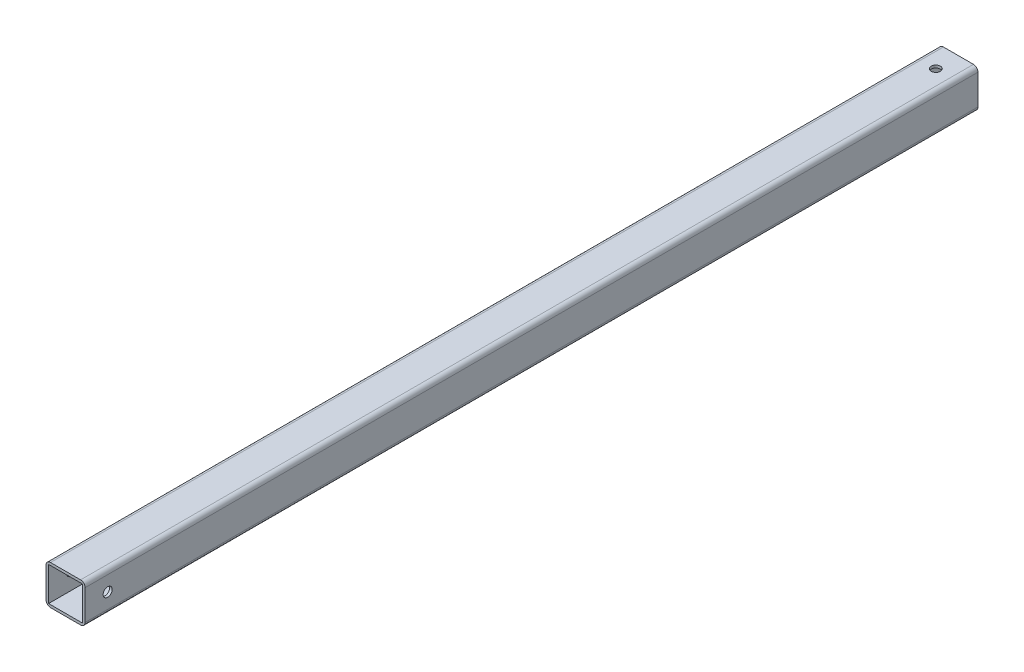
ISO-10303-21;
HEADER;
FILE_DESCRIPTION(('STEP AP214'),'2;1');
FILE_NAME('part.step','',(''),(''),'','','');
FILE_SCHEMA(('AUTOMOTIVE_DESIGN { 1 0 10303 214 1 1 1 1 }'));
ENDSEC;
DATA;
#1=APPLICATION_CONTEXT('core data for automotive mechanical design processes');
#2=APPLICATION_PROTOCOL_DEFINITION('international standard','automotive_design',2000,#1);
#3=PRODUCT_CONTEXT('',#1,'mechanical');
#4=PRODUCT('Part','Part','',(#3));
#5=PRODUCT_RELATED_PRODUCT_CATEGORY('part','',(#4));
#6=PRODUCT_DEFINITION_FORMATION('','',#4);
#7=PRODUCT_DEFINITION_CONTEXT('part definition',#1,'design');
#8=PRODUCT_DEFINITION('design','',#6,#7);
#9=PRODUCT_DEFINITION_SHAPE('','',#8);
#10=(LENGTH_UNIT() NAMED_UNIT(*) SI_UNIT(.MILLI.,.METRE.));
#11=(NAMED_UNIT(*) PLANE_ANGLE_UNIT() SI_UNIT($,.RADIAN.));
#12=(NAMED_UNIT(*) SI_UNIT($,.STERADIAN.) SOLID_ANGLE_UNIT());
#13=UNCERTAINTY_MEASURE_WITH_UNIT(LENGTH_MEASURE(1.E-05),#10,'distance_accuracy_value','');
#14=(GEOMETRIC_REPRESENTATION_CONTEXT(3) GLOBAL_UNCERTAINTY_ASSIGNED_CONTEXT((#13)) GLOBAL_UNIT_ASSIGNED_CONTEXT((#10,
#11,#12)) REPRESENTATION_CONTEXT('',''));
#15=CARTESIAN_POINT('',(0.,0.,0.));
#16=DIRECTION('',(0.,0.,1.));
#17=DIRECTION('',(1.,0.,0.));
#18=AXIS2_PLACEMENT_3D('',#15,#16,#17);
#19=CARTESIAN_POINT('',(0.,0.,501.65));
#20=DIRECTION('',(0.,0.,1.));
#21=DIRECTION('',(1.,0.,0.));
#22=AXIS2_PLACEMENT_3D('',#19,#20,#21);
#23=PLANE('',#22);
#24=DIRECTION('',(0.,-1.,0.));
#25=VECTOR('',#24,1.);
#26=CARTESIAN_POINT('',(-10.9855,-10.9855,501.65));
#27=LINE('',#26,#25);
#28=CARTESIAN_POINT('',(-10.9855,8.44549999999999,501.65));
#29=VERTEX_POINT('',#28);
#30=CARTESIAN_POINT('',(-10.9855,-8.4455,501.65));
#31=VERTEX_POINT('',#30);
#32=EDGE_CURVE('E168',#29,#31,#27,.T.);
#33=ORIENTED_EDGE('',*,*,#32,.T.);
#34=CARTESIAN_POINT('',(-8.4455,-8.4455,501.65));
#35=DIRECTION('',(0.,0.,1.));
#36=DIRECTION('',(1.,0.,0.));
#37=AXIS2_PLACEMENT_3D('',#34,#35,#36);
#38=CIRCLE('',#37,2.54);
#39=CARTESIAN_POINT('',(-8.44549999999999,-10.9855,501.65));
#40=VERTEX_POINT('',#39);
#41=EDGE_CURVE('E211',#31,#40,#38,.T.);
#42=ORIENTED_EDGE('',*,*,#41,.T.);
#43=DIRECTION('',(1.,0.,0.));
#44=VECTOR('',#43,1.);
#45=CARTESIAN_POINT('',(10.9855,-10.9855,501.65));
#46=LINE('',#45,#44);
#47=CARTESIAN_POINT('',(8.4455,-10.9855,501.65));
#48=VERTEX_POINT('',#47);
#49=EDGE_CURVE('E171',#40,#48,#46,.T.);
#50=ORIENTED_EDGE('',*,*,#49,.T.);
#51=CARTESIAN_POINT('',(8.4455,-8.4455,501.65));
#52=DIRECTION('',(0.,0.,1.));
#53=DIRECTION('',(1.,0.,0.));
#54=AXIS2_PLACEMENT_3D('',#51,#52,#53);
#55=CIRCLE('',#54,2.54);
#56=CARTESIAN_POINT('',(10.9855,-8.4455,501.65));
#57=VERTEX_POINT('',#56);
#58=EDGE_CURVE('E209',#48,#57,#55,.T.);
#59=ORIENTED_EDGE('',*,*,#58,.T.);
#60=DIRECTION('',(0.,1.,0.));
#61=VECTOR('',#60,1.);
#62=CARTESIAN_POINT('',(10.9855,-10.9855,501.65));
#63=LINE('',#62,#61);
#64=CARTESIAN_POINT('',(10.9855,8.44549999999999,501.65));
#65=VERTEX_POINT('',#64);
#66=EDGE_CURVE('E175',#57,#65,#63,.T.);
#67=ORIENTED_EDGE('',*,*,#66,.T.);
#68=CARTESIAN_POINT('',(8.4455,8.4455,501.65));
#69=DIRECTION('',(0.,0.,1.));
#70=DIRECTION('',(1.,0.,0.));
#71=AXIS2_PLACEMENT_3D('',#68,#69,#70);
#72=CIRCLE('',#71,2.54);
#73=CARTESIAN_POINT('',(8.4455,10.9855,501.65));
#74=VERTEX_POINT('',#73);
#75=EDGE_CURVE('E55',#65,#74,#72,.T.);
#76=ORIENTED_EDGE('',*,*,#75,.T.);
#77=DIRECTION('',(-1.,0.,0.));
#78=VECTOR('',#77,1.);
#79=CARTESIAN_POINT('',(10.9855,10.9855,501.65));
#80=LINE('',#79,#78);
#81=CARTESIAN_POINT('',(-8.44549999999999,10.9855,501.65));
#82=VERTEX_POINT('',#81);
#83=EDGE_CURVE('E177',#74,#82,#80,.T.);
#84=ORIENTED_EDGE('',*,*,#83,.T.);
#85=CARTESIAN_POINT('',(-8.4455,8.4455,501.65));
#86=DIRECTION('',(0.,0.,1.));
#87=DIRECTION('',(1.,0.,0.));
#88=AXIS2_PLACEMENT_3D('',#85,#86,#87);
#89=CIRCLE('',#88,2.54);
#90=EDGE_CURVE('E207',#82,#29,#89,.T.);
#91=ORIENTED_EDGE('',*,*,#90,.T.);
#92=EDGE_LOOP('',(#33,#42,#50,#59,#67,#76,#84,#91));
#93=FACE_BOUND('',#92,.T.);
#94=DIRECTION('',(1.,0.,0.));
#95=VECTOR('',#94,1.);
#96=CARTESIAN_POINT('',(9.525,-9.525,501.65));
#97=LINE('',#96,#95);
#98=CARTESIAN_POINT('',(-9.525,-9.525,501.65));
#99=VERTEX_POINT('',#98);
#100=CARTESIAN_POINT('',(9.525,-9.525,501.65));
#101=VERTEX_POINT('',#100);
#102=EDGE_CURVE('E135',#99,#101,#97,.T.);
#103=ORIENTED_EDGE('',*,*,#102,.F.);
#104=DIRECTION('',(0.,-1.,0.));
#105=VECTOR('',#104,1.);
#106=CARTESIAN_POINT('',(-9.525,-9.525,501.65));
#107=LINE('',#106,#105);
#108=CARTESIAN_POINT('',(-9.525,9.52499999999999,501.65));
#109=VERTEX_POINT('',#108);
#110=EDGE_CURVE('E125',#109,#99,#107,.T.);
#111=ORIENTED_EDGE('',*,*,#110,.F.);
#112=DIRECTION('',(-1.,0.,0.));
#113=VECTOR('',#112,1.);
#114=CARTESIAN_POINT('',(9.525,9.52499999999999,501.65));
#115=LINE('',#114,#113);
#116=CARTESIAN_POINT('',(9.525,9.52499999999999,501.65));
#117=VERTEX_POINT('',#116);
#118=EDGE_CURVE('E150',#117,#109,#115,.T.);
#119=ORIENTED_EDGE('',*,*,#118,.F.);
#120=DIRECTION('',(0.,1.,0.));
#121=VECTOR('',#120,1.);
#122=CARTESIAN_POINT('',(9.525,-9.525,501.65));
#123=LINE('',#122,#121);
#124=EDGE_CURVE('E148',#101,#117,#123,.T.);
#125=ORIENTED_EDGE('',*,*,#124,.F.);
#126=EDGE_LOOP('',(#103,#111,#119,#125));
#127=FACE_BOUND('',#126,.T.);
#128=ADVANCED_FACE('F34',(#93,#127),#23,.T.);
#129=CARTESIAN_POINT('',(0.,0.,0.));
#130=DIRECTION('',(0.,0.,1.));
#131=DIRECTION('',(1.,0.,0.));
#132=AXIS2_PLACEMENT_3D('',#129,#130,#131);
#133=PLANE('',#132);
#134=DIRECTION('',(1.,0.,0.));
#135=VECTOR('',#134,1.);
#136=CARTESIAN_POINT('',(10.9855,-10.9855,0.));
#137=LINE('',#136,#135);
#138=CARTESIAN_POINT('',(-8.44549999999999,-10.9855,0.));
#139=VERTEX_POINT('',#138);
#140=CARTESIAN_POINT('',(8.4455,-10.9855,0.));
#141=VERTEX_POINT('',#140);
#142=EDGE_CURVE('E182',#139,#141,#137,.T.);
#143=ORIENTED_EDGE('',*,*,#142,.F.);
#144=CARTESIAN_POINT('',(-8.4455,-8.4455,0.));
#145=DIRECTION('',(0.,0.,1.));
#146=DIRECTION('',(1.,0.,0.));
#147=AXIS2_PLACEMENT_3D('',#144,#145,#146);
#148=CIRCLE('',#147,2.54);
#149=CARTESIAN_POINT('',(-10.9855,-8.4455,0.));
#150=VERTEX_POINT('',#149);
#151=EDGE_CURVE('E199',#139,#150,#148,.F.);
#152=ORIENTED_EDGE('',*,*,#151,.T.);
#153=DIRECTION('',(0.,-1.,0.));
#154=VECTOR('',#153,1.);
#155=CARTESIAN_POINT('',(-10.9855,-10.9855,0.));
#156=LINE('',#155,#154);
#157=CARTESIAN_POINT('',(-10.9855,8.44549999999999,0.));
#158=VERTEX_POINT('',#157);
#159=EDGE_CURVE('E143',#158,#150,#156,.T.);
#160=ORIENTED_EDGE('',*,*,#159,.F.);
#161=CARTESIAN_POINT('',(-8.4455,8.4455,0.));
#162=DIRECTION('',(0.,0.,1.));
#163=DIRECTION('',(1.,0.,0.));
#164=AXIS2_PLACEMENT_3D('',#161,#162,#163);
#165=CIRCLE('',#164,2.54);
#166=CARTESIAN_POINT('',(-8.44549999999999,10.9855,0.));
#167=VERTEX_POINT('',#166);
#168=EDGE_CURVE('E195',#158,#167,#165,.F.);
#169=ORIENTED_EDGE('',*,*,#168,.T.);
#170=DIRECTION('',(-1.,0.,0.));
#171=VECTOR('',#170,1.);
#172=CARTESIAN_POINT('',(10.9855,10.9855,0.));
#173=LINE('',#172,#171);
#174=CARTESIAN_POINT('',(8.4455,10.9855,0.));
#175=VERTEX_POINT('',#174);
#176=EDGE_CURVE('E172',#175,#167,#173,.T.);
#177=ORIENTED_EDGE('',*,*,#176,.F.);
#178=CARTESIAN_POINT('',(8.4455,8.4455,0.));
#179=DIRECTION('',(0.,0.,1.));
#180=DIRECTION('',(1.,0.,0.));
#181=AXIS2_PLACEMENT_3D('',#178,#179,#180);
#182=CIRCLE('',#181,2.54);
#183=CARTESIAN_POINT('',(10.9855,8.44549999999999,0.));
#184=VERTEX_POINT('',#183);
#185=EDGE_CURVE('E193',#175,#184,#182,.F.);
#186=ORIENTED_EDGE('',*,*,#185,.T.);
#187=DIRECTION('',(0.,1.,0.));
#188=VECTOR('',#187,1.);
#189=CARTESIAN_POINT('',(10.9855,-10.9855,0.));
#190=LINE('',#189,#188);
#191=CARTESIAN_POINT('',(10.9855,-8.4455,0.));
#192=VERTEX_POINT('',#191);
#193=EDGE_CURVE('E185',#192,#184,#190,.T.);
#194=ORIENTED_EDGE('',*,*,#193,.F.);
#195=CARTESIAN_POINT('',(8.4455,-8.4455,0.));
#196=DIRECTION('',(0.,0.,1.));
#197=DIRECTION('',(1.,0.,0.));
#198=AXIS2_PLACEMENT_3D('',#195,#196,#197);
#199=CIRCLE('',#198,2.54);
#200=EDGE_CURVE('E197',#192,#141,#199,.F.);
#201=ORIENTED_EDGE('',*,*,#200,.T.);
#202=EDGE_LOOP('',(#143,#152,#160,#169,#177,#186,#194,#201));
#203=FACE_BOUND('',#202,.T.);
#204=DIRECTION('',(0.,-1.,0.));
#205=VECTOR('',#204,1.);
#206=CARTESIAN_POINT('',(-9.525,-9.525,0.));
#207=LINE('',#206,#205);
#208=CARTESIAN_POINT('',(-9.525,9.52499999999999,0.));
#209=VERTEX_POINT('',#208);
#210=CARTESIAN_POINT('',(-9.525,-9.525,0.));
#211=VERTEX_POINT('',#210);
#212=EDGE_CURVE('E155',#209,#211,#207,.T.);
#213=ORIENTED_EDGE('',*,*,#212,.T.);
#214=DIRECTION('',(1.,0.,0.));
#215=VECTOR('',#214,1.);
#216=CARTESIAN_POINT('',(9.525,-9.525,0.));
#217=LINE('',#216,#215);
#218=CARTESIAN_POINT('',(9.525,-9.525,0.));
#219=VERTEX_POINT('',#218);
#220=EDGE_CURVE('E142',#211,#219,#217,.T.);
#221=ORIENTED_EDGE('',*,*,#220,.T.);
#222=DIRECTION('',(0.,1.,0.));
#223=VECTOR('',#222,1.);
#224=CARTESIAN_POINT('',(9.525,-9.525,0.));
#225=LINE('',#224,#223);
#226=CARTESIAN_POINT('',(9.525,9.52499999999999,0.));
#227=VERTEX_POINT('',#226);
#228=EDGE_CURVE('E159',#219,#227,#225,.T.);
#229=ORIENTED_EDGE('',*,*,#228,.T.);
#230=DIRECTION('',(-1.,0.,0.));
#231=VECTOR('',#230,1.);
#232=CARTESIAN_POINT('',(9.525,9.52499999999999,0.));
#233=LINE('',#232,#231);
#234=EDGE_CURVE('E136',#227,#209,#233,.T.);
#235=ORIENTED_EDGE('',*,*,#234,.T.);
#236=EDGE_LOOP('',(#213,#221,#229,#235));
#237=FACE_BOUND('',#236,.T.);
#238=ADVANCED_FACE('F225',(#203,#237),#133,.F.);
#239=CARTESIAN_POINT('',(-10.9855,-10.9855,501.65));
#240=DIRECTION('',(1.,0.,0.));
#241=DIRECTION('',(0.,0.,-1.));
#242=AXIS2_PLACEMENT_3D('',#239,#240,#241);
#243=PLANE('',#242);
#244=CARTESIAN_POINT('',(-10.9855,0.,488.95));
#245=DIRECTION('',(1.,0.,0.));
#246=DIRECTION('',(0.,0.,-1.));
#247=AXIS2_PLACEMENT_3D('',#244,#245,#246);
#248=CIRCLE('',#247,2.5527);
#249=CARTESIAN_POINT('',(-10.9855,0.,486.3973));
#250=VERTEX_POINT('',#249);
#251=EDGE_CURVE('E406',#250,#250,#248,.T.);
#252=ORIENTED_EDGE('',*,*,#251,.T.);
#253=EDGE_LOOP('',(#252));
#254=FACE_BOUND('',#253,.T.);
#255=ORIENTED_EDGE('',*,*,#159,.T.);
#256=DIRECTION('',(0.,0.,-1.));
#257=VECTOR('',#256,1.);
#258=CARTESIAN_POINT('',(-10.9855,-8.4455,501.65));
#259=LINE('',#258,#257);
#260=EDGE_CURVE('E204',#150,#31,#259,.F.);
#261=ORIENTED_EDGE('',*,*,#260,.T.);
#262=ORIENTED_EDGE('',*,*,#32,.F.);
#263=DIRECTION('',(0.,0.,-1.));
#264=VECTOR('',#263,1.);
#265=CARTESIAN_POINT('',(-10.9855,8.4455,501.65));
#266=LINE('',#265,#264);
#267=EDGE_CURVE('E201',#29,#158,#266,.T.);
#268=ORIENTED_EDGE('',*,*,#267,.T.);
#269=EDGE_LOOP('',(#255,#261,#262,#268));
#270=FACE_BOUND('',#269,.T.);
#271=ADVANCED_FACE('F235',(#254,#270),#243,.F.);
#272=CARTESIAN_POINT('',(10.9855,-10.9855,501.65));
#273=DIRECTION('',(0.,1.,0.));
#274=DIRECTION('',(-1.,0.,0.));
#275=AXIS2_PLACEMENT_3D('',#272,#273,#274);
#276=PLANE('',#275);
#277=ORIENTED_EDGE('',*,*,#49,.F.);
#278=DIRECTION('',(0.,0.,-1.));
#279=VECTOR('',#278,1.);
#280=CARTESIAN_POINT('',(-8.4455,-10.9855,501.65));
#281=LINE('',#280,#279);
#282=EDGE_CURVE('E190',#40,#139,#281,.T.);
#283=ORIENTED_EDGE('',*,*,#282,.T.);
#284=ORIENTED_EDGE('',*,*,#142,.T.);
#285=DIRECTION('',(0.,0.,-1.));
#286=VECTOR('',#285,1.);
#287=CARTESIAN_POINT('',(8.4455,-10.9855,501.65));
#288=LINE('',#287,#286);
#289=EDGE_CURVE('E179',#141,#48,#288,.F.);
#290=ORIENTED_EDGE('',*,*,#289,.T.);
#291=EDGE_LOOP('',(#277,#283,#284,#290));
#292=FACE_BOUND('',#291,.T.);
#293=ADVANCED_FACE('F243',(#292),#276,.F.);
#294=CARTESIAN_POINT('',(10.9855,-10.9855,501.65));
#295=DIRECTION('',(-1.,0.,0.));
#296=DIRECTION('',(0.,0.,1.));
#297=AXIS2_PLACEMENT_3D('',#294,#295,#296);
#298=PLANE('',#297);
#299=CARTESIAN_POINT('',(10.9855,0.,488.95));
#300=DIRECTION('',(1.,0.,0.));
#301=DIRECTION('',(0.,0.,-1.));
#302=AXIS2_PLACEMENT_3D('',#299,#300,#301);
#303=CIRCLE('',#302,2.55269999999999);
#304=CARTESIAN_POINT('',(10.9855,0.,486.3973));
#305=VERTEX_POINT('',#304);
#306=EDGE_CURVE('E407',#305,#305,#303,.T.);
#307=ORIENTED_EDGE('',*,*,#306,.F.);
#308=EDGE_LOOP('',(#307));
#309=FACE_BOUND('',#308,.T.);
#310=ORIENTED_EDGE('',*,*,#66,.F.);
#311=DIRECTION('',(0.,0.,-1.));
#312=VECTOR('',#311,1.);
#313=CARTESIAN_POINT('',(10.9855,-8.4455,501.65));
#314=LINE('',#313,#312);
#315=EDGE_CURVE('E215',#57,#192,#314,.T.);
#316=ORIENTED_EDGE('',*,*,#315,.T.);
#317=ORIENTED_EDGE('',*,*,#193,.T.);
#318=DIRECTION('',(0.,0.,-1.));
#319=VECTOR('',#318,1.);
#320=CARTESIAN_POINT('',(10.9855,8.4455,501.65));
#321=LINE('',#320,#319);
#322=EDGE_CURVE('E213',#184,#65,#321,.F.);
#323=ORIENTED_EDGE('',*,*,#322,.T.);
#324=EDGE_LOOP('',(#310,#316,#317,#323));
#325=FACE_BOUND('',#324,.T.);
#326=ADVANCED_FACE('F251',(#309,#325),#298,.F.);
#327=CARTESIAN_POINT('',(10.9855,10.9855,501.65));
#328=DIRECTION('',(0.,-1.,0.));
#329=DIRECTION('',(0.,0.,-1.));
#330=AXIS2_PLACEMENT_3D('',#327,#328,#329);
#331=PLANE('',#330);
#332=CARTESIAN_POINT('',(0.,10.9855,12.7));
#333=DIRECTION('',(0.,1.,0.));
#334=DIRECTION('',(0.,0.,1.));
#335=AXIS2_PLACEMENT_3D('',#332,#333,#334);
#336=CIRCLE('',#335,2.5527);
#337=CARTESIAN_POINT('',(0.,10.9855,15.2527));
#338=VERTEX_POINT('',#337);
#339=EDGE_CURVE('E414',#338,#338,#336,.T.);
#340=ORIENTED_EDGE('',*,*,#339,.F.);
#341=EDGE_LOOP('',(#340));
#342=FACE_BOUND('',#341,.T.);
#343=ORIENTED_EDGE('',*,*,#176,.T.);
#344=DIRECTION('',(0.,0.,-1.));
#345=VECTOR('',#344,1.);
#346=CARTESIAN_POINT('',(-8.4455,10.9855,501.65));
#347=LINE('',#346,#345);
#348=EDGE_CURVE('E11',#167,#82,#347,.F.);
#349=ORIENTED_EDGE('',*,*,#348,.T.);
#350=ORIENTED_EDGE('',*,*,#83,.F.);
#351=DIRECTION('',(0.,0.,-1.));
#352=VECTOR('',#351,1.);
#353=CARTESIAN_POINT('',(8.4455,10.9855,501.65));
#354=LINE('',#353,#352);
#355=EDGE_CURVE('E43',#74,#175,#354,.T.);
#356=ORIENTED_EDGE('',*,*,#355,.T.);
#357=EDGE_LOOP('',(#343,#349,#350,#356));
#358=FACE_BOUND('',#357,.T.);
#359=ADVANCED_FACE('F221',(#342,#358),#331,.F.);
#360=CARTESIAN_POINT('',(-9.525,-9.525,501.65));
#361=DIRECTION('',(1.,0.,0.));
#362=DIRECTION('',(0.,0.,-1.));
#363=AXIS2_PLACEMENT_3D('',#360,#361,#362);
#364=PLANE('',#363);
#365=CARTESIAN_POINT('',(-9.525,0.,488.95));
#366=DIRECTION('',(1.,0.,0.));
#367=DIRECTION('',(0.,0.,-1.));
#368=AXIS2_PLACEMENT_3D('',#365,#366,#367);
#369=CIRCLE('',#368,2.55269999999999);
#370=CARTESIAN_POINT('',(-9.525,0.,486.3973));
#371=VERTEX_POINT('',#370);
#372=EDGE_CURVE('E403',#371,#371,#369,.T.);
#373=ORIENTED_EDGE('',*,*,#372,.F.);
#374=EDGE_LOOP('',(#373));
#375=FACE_BOUND('',#374,.T.);
#376=ORIENTED_EDGE('',*,*,#212,.F.);
#377=DIRECTION('',(0.,0.,-1.));
#378=VECTOR('',#377,1.);
#379=CARTESIAN_POINT('',(-9.525,9.52499999999999,501.65));
#380=LINE('',#379,#378);
#381=EDGE_CURVE('E131',#109,#209,#380,.T.);
#382=ORIENTED_EDGE('',*,*,#381,.F.);
#383=ORIENTED_EDGE('',*,*,#110,.T.);
#384=DIRECTION('',(0.,0.,-1.));
#385=VECTOR('',#384,1.);
#386=CARTESIAN_POINT('',(-9.525,-9.525,501.65));
#387=LINE('',#386,#385);
#388=EDGE_CURVE('E128',#99,#211,#387,.T.);
#389=ORIENTED_EDGE('',*,*,#388,.T.);
#390=EDGE_LOOP('',(#376,#382,#383,#389));
#391=FACE_BOUND('',#390,.T.);
#392=ADVANCED_FACE('F127',(#375,#391),#364,.T.);
#393=CARTESIAN_POINT('',(9.525,-9.525,501.65));
#394=DIRECTION('',(0.,1.,0.));
#395=DIRECTION('',(0.,0.,1.));
#396=AXIS2_PLACEMENT_3D('',#393,#394,#395);
#397=PLANE('',#396);
#398=ORIENTED_EDGE('',*,*,#220,.F.);
#399=ORIENTED_EDGE('',*,*,#388,.F.);
#400=ORIENTED_EDGE('',*,*,#102,.T.);
#401=DIRECTION('',(0.,0.,-1.));
#402=VECTOR('',#401,1.);
#403=CARTESIAN_POINT('',(9.525,-9.525,501.65));
#404=LINE('',#403,#402);
#405=EDGE_CURVE('E144',#101,#219,#404,.T.);
#406=ORIENTED_EDGE('',*,*,#405,.T.);
#407=EDGE_LOOP('',(#398,#399,#400,#406));
#408=FACE_BOUND('',#407,.T.);
#409=ADVANCED_FACE('F139',(#408),#397,.T.);
#410=CARTESIAN_POINT('',(9.525,-9.525,501.65));
#411=DIRECTION('',(-1.,0.,0.));
#412=DIRECTION('',(0.,0.,1.));
#413=AXIS2_PLACEMENT_3D('',#410,#411,#412);
#414=PLANE('',#413);
#415=CARTESIAN_POINT('',(9.525,0.,488.95));
#416=DIRECTION('',(-1.,0.,0.));
#417=DIRECTION('',(0.,0.,1.));
#418=AXIS2_PLACEMENT_3D('',#415,#416,#417);
#419=CIRCLE('',#418,2.55269999999999);
#420=CARTESIAN_POINT('',(9.525,0.,491.5027));
#421=VERTEX_POINT('',#420);
#422=EDGE_CURVE('E38',#421,#421,#419,.T.);
#423=ORIENTED_EDGE('',*,*,#422,.F.);
#424=EDGE_LOOP('',(#423));
#425=FACE_BOUND('',#424,.T.);
#426=ORIENTED_EDGE('',*,*,#228,.F.);
#427=ORIENTED_EDGE('',*,*,#405,.F.);
#428=ORIENTED_EDGE('',*,*,#124,.T.);
#429=DIRECTION('',(0.,0.,-1.));
#430=VECTOR('',#429,1.);
#431=CARTESIAN_POINT('',(9.525,9.52499999999999,501.65));
#432=LINE('',#431,#430);
#433=EDGE_CURVE('E165',#117,#227,#432,.T.);
#434=ORIENTED_EDGE('',*,*,#433,.T.);
#435=EDGE_LOOP('',(#426,#427,#428,#434));
#436=FACE_BOUND('',#435,.T.);
#437=ADVANCED_FACE('F317',(#425,#436),#414,.T.);
#438=CARTESIAN_POINT('',(9.525,9.52499999999999,501.65));
#439=DIRECTION('',(0.,-1.,0.));
#440=DIRECTION('',(0.,0.,-1.));
#441=AXIS2_PLACEMENT_3D('',#438,#439,#440);
#442=PLANE('',#441);
#443=CARTESIAN_POINT('',(0.,9.52499999999999,12.7));
#444=DIRECTION('',(0.,-1.,0.));
#445=DIRECTION('',(0.,0.,-1.));
#446=AXIS2_PLACEMENT_3D('',#443,#444,#445);
#447=CIRCLE('',#446,2.5527);
#448=CARTESIAN_POINT('',(0.,9.52499999999999,10.1473));
#449=VERTEX_POINT('',#448);
#450=EDGE_CURVE('E157',#449,#449,#447,.T.);
#451=ORIENTED_EDGE('',*,*,#450,.F.);
#452=EDGE_LOOP('',(#451));
#453=FACE_BOUND('',#452,.T.);
#454=ORIENTED_EDGE('',*,*,#234,.F.);
#455=ORIENTED_EDGE('',*,*,#433,.F.);
#456=ORIENTED_EDGE('',*,*,#118,.T.);
#457=ORIENTED_EDGE('',*,*,#381,.T.);
#458=EDGE_LOOP('',(#454,#455,#456,#457));
#459=FACE_BOUND('',#458,.T.);
#460=ADVANCED_FACE('F284',(#453,#459),#442,.T.);
#461=CARTESIAN_POINT('',(-8.4455,-8.4455,501.65));
#462=DIRECTION('',(0.,0.,-1.));
#463=DIRECTION('',(-1.,0.,0.));
#464=AXIS2_PLACEMENT_3D('',#461,#462,#463);
#465=CYLINDRICAL_SURFACE('',#464,2.54);
#466=ORIENTED_EDGE('',*,*,#41,.F.);
#467=ORIENTED_EDGE('',*,*,#260,.F.);
#468=ORIENTED_EDGE('',*,*,#151,.F.);
#469=ORIENTED_EDGE('',*,*,#282,.F.);
#470=EDGE_LOOP('',(#466,#467,#468,#469));
#471=FACE_BOUND('',#470,.T.);
#472=ADVANCED_FACE('F241',(#471),#465,.T.);
#473=CARTESIAN_POINT('',(8.4455,-8.4455,501.65));
#474=DIRECTION('',(0.,0.,-1.));
#475=DIRECTION('',(-1.,0.,0.));
#476=AXIS2_PLACEMENT_3D('',#473,#474,#475);
#477=CYLINDRICAL_SURFACE('',#476,2.54);
#478=ORIENTED_EDGE('',*,*,#58,.F.);
#479=ORIENTED_EDGE('',*,*,#289,.F.);
#480=ORIENTED_EDGE('',*,*,#200,.F.);
#481=ORIENTED_EDGE('',*,*,#315,.F.);
#482=EDGE_LOOP('',(#478,#479,#480,#481));
#483=FACE_BOUND('',#482,.T.);
#484=ADVANCED_FACE('F248',(#483),#477,.T.);
#485=CARTESIAN_POINT('',(-8.4455,8.4455,501.65));
#486=DIRECTION('',(0.,0.,-1.));
#487=DIRECTION('',(-1.,0.,0.));
#488=AXIS2_PLACEMENT_3D('',#485,#486,#487);
#489=CYLINDRICAL_SURFACE('',#488,2.54);
#490=ORIENTED_EDGE('',*,*,#90,.F.);
#491=ORIENTED_EDGE('',*,*,#348,.F.);
#492=ORIENTED_EDGE('',*,*,#168,.F.);
#493=ORIENTED_EDGE('',*,*,#267,.F.);
#494=EDGE_LOOP('',(#490,#491,#492,#493));
#495=FACE_BOUND('',#494,.T.);
#496=ADVANCED_FACE('F232',(#495),#489,.T.);
#497=CARTESIAN_POINT('',(8.4455,8.4455,501.65));
#498=DIRECTION('',(0.,0.,-1.));
#499=DIRECTION('',(-1.,0.,0.));
#500=AXIS2_PLACEMENT_3D('',#497,#498,#499);
#501=CYLINDRICAL_SURFACE('',#500,2.54);
#502=ORIENTED_EDGE('',*,*,#75,.F.);
#503=ORIENTED_EDGE('',*,*,#322,.F.);
#504=ORIENTED_EDGE('',*,*,#185,.F.);
#505=ORIENTED_EDGE('',*,*,#355,.F.);
#506=EDGE_LOOP('',(#502,#503,#504,#505));
#507=FACE_BOUND('',#506,.T.);
#508=ADVANCED_FACE('F36',(#507),#501,.T.);
#509=CARTESIAN_POINT('',(0.,10.9855,12.7));
#510=DIRECTION('',(0.,1.,0.));
#511=DIRECTION('',(0.,0.,1.));
#512=AXIS2_PLACEMENT_3D('',#509,#510,#511);
#513=CYLINDRICAL_SURFACE('',#512,2.5527);
#514=ORIENTED_EDGE('',*,*,#450,.T.);
#515=EDGE_LOOP('',(#514));
#516=FACE_BOUND('',#515,.T.);
#517=ORIENTED_EDGE('',*,*,#339,.T.);
#518=EDGE_LOOP('',(#517));
#519=FACE_BOUND('',#518,.T.);
#520=ADVANCED_FACE('F254',(#516,#519),#513,.F.);
#521=CARTESIAN_POINT('',(10.9855,0.,488.95));
#522=DIRECTION('',(1.,0.,0.));
#523=DIRECTION('',(0.,0.,-1.));
#524=AXIS2_PLACEMENT_3D('',#521,#522,#523);
#525=CYLINDRICAL_SURFACE('',#524,2.55269999999999);
#526=ORIENTED_EDGE('',*,*,#422,.T.);
#527=EDGE_LOOP('',(#526));
#528=FACE_BOUND('',#527,.T.);
#529=ORIENTED_EDGE('',*,*,#306,.T.);
#530=EDGE_LOOP('',(#529));
#531=FACE_BOUND('',#530,.T.);
#532=ADVANCED_FACE('F259',(#528,#531),#525,.F.);
#533=ORIENTED_EDGE('',*,*,#372,.T.);
#534=EDGE_LOOP('',(#533));
#535=FACE_BOUND('',#534,.T.);
#536=ORIENTED_EDGE('',*,*,#251,.F.);
#537=EDGE_LOOP('',(#536));
#538=FACE_BOUND('',#537,.T.);
#539=ADVANCED_FACE('F363',(#535,#538),#525,.F.);
#540=CLOSED_SHELL('',(#128,#238,#271,#293,#326,#359,#392,#409,#437,#460,#472,#484,#496,#508,
#520,#532,#539));
#541=MANIFOLD_SOLID_BREP('B2',#540);
#542=ADVANCED_BREP_SHAPE_REPRESENTATION('',(#18,#541),#14);
#543=SHAPE_DEFINITION_REPRESENTATION(#9,#542);
ENDSEC;
END-ISO-10303-21;
